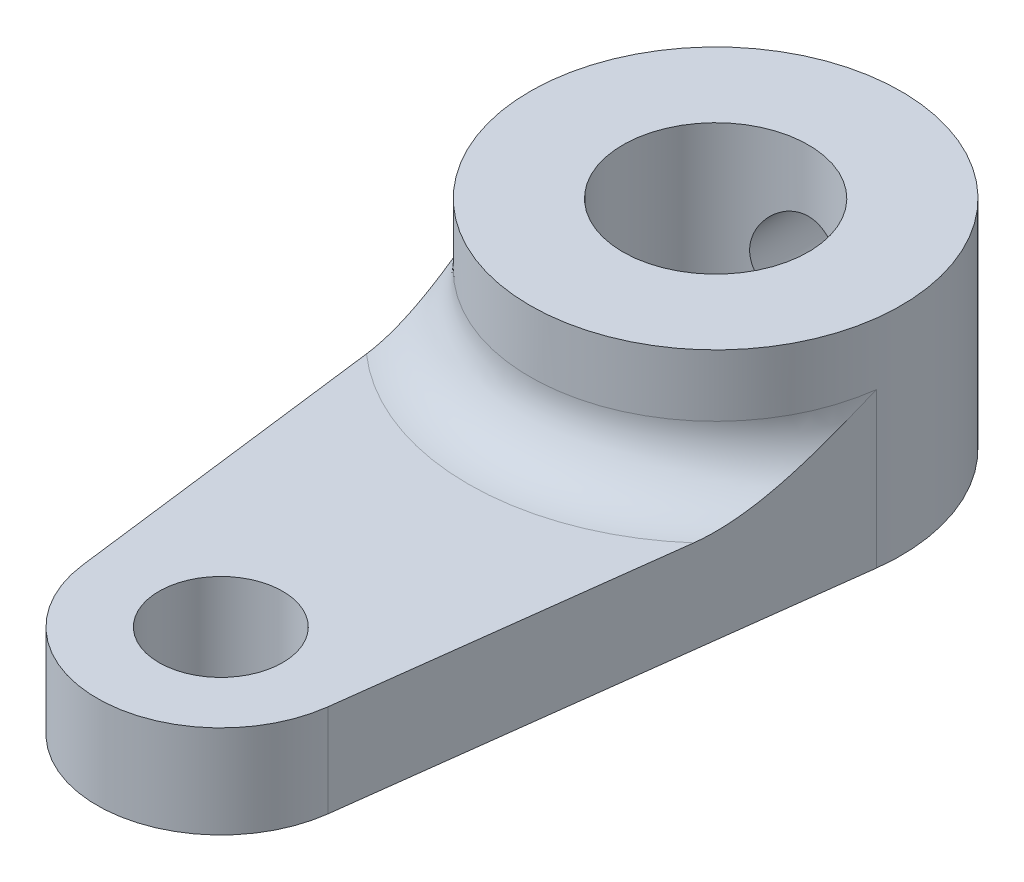
ISO-10303-21;
HEADER;
FILE_DESCRIPTION(('STEP AP214'),'2;1');
FILE_NAME('part.step','',(''),(''),'','','');
FILE_SCHEMA(('AUTOMOTIVE_DESIGN { 1 0 10303 214 1 1 1 1 }'));
ENDSEC;
DATA;
#1=APPLICATION_CONTEXT('core data for automotive mechanical design processes');
#2=APPLICATION_PROTOCOL_DEFINITION('international standard','automotive_design',2000,#1);
#3=PRODUCT_CONTEXT('',#1,'mechanical');
#4=PRODUCT('Part','Part','',(#3));
#5=PRODUCT_RELATED_PRODUCT_CATEGORY('part','',(#4));
#6=PRODUCT_DEFINITION_FORMATION('','',#4);
#7=PRODUCT_DEFINITION_CONTEXT('part definition',#1,'design');
#8=PRODUCT_DEFINITION('design','',#6,#7);
#9=PRODUCT_DEFINITION_SHAPE('','',#8);
#10=(LENGTH_UNIT() NAMED_UNIT(*) SI_UNIT(.MILLI.,.METRE.));
#11=(NAMED_UNIT(*) PLANE_ANGLE_UNIT() SI_UNIT($,.RADIAN.));
#12=(NAMED_UNIT(*) SI_UNIT($,.STERADIAN.) SOLID_ANGLE_UNIT());
#13=UNCERTAINTY_MEASURE_WITH_UNIT(LENGTH_MEASURE(1.E-05),#10,'distance_accuracy_value','');
#14=(GEOMETRIC_REPRESENTATION_CONTEXT(3) GLOBAL_UNCERTAINTY_ASSIGNED_CONTEXT((#13)) GLOBAL_UNIT_ASSIGNED_CONTEXT((#10,
#11,#12)) REPRESENTATION_CONTEXT('',''));
#15=CARTESIAN_POINT('',(0.,0.,0.));
#16=DIRECTION('',(0.,0.,1.));
#17=DIRECTION('',(1.,0.,0.));
#18=AXIS2_PLACEMENT_3D('',#15,#16,#17);
#19=CARTESIAN_POINT('',(-5.95294044989533,3.,0.750000000000001));
#20=DIRECTION('',(0.992156741649221,0.,-0.125));
#21=DIRECTION('',(-0.125,0.,-0.992156741649222));
#22=AXIS2_PLACEMENT_3D('',#19,#20,#21);
#23=PLANE('',#22);
#24=DIRECTION('',(0.125,0.,0.992156741649222));
#25=VECTOR('',#24,1.);
#26=CARTESIAN_POINT('',(-5.95294044989533,0.,0.750000000000001));
#27=LINE('',#26,#25);
#28=CARTESIAN_POINT('',(-5.95294044989533,0.,0.750000000000001));
#29=VERTEX_POINT('',#28);
#30=CARTESIAN_POINT('',(-3.96862696659688,0.,16.5));
#31=VERTEX_POINT('',#30);
#32=EDGE_CURVE('E168',#29,#31,#27,.T.);
#33=ORIENTED_EDGE('',*,*,#32,.T.);
#34=DIRECTION('',(0.,-1.,0.));
#35=VECTOR('',#34,1.);
#36=CARTESIAN_POINT('',(-3.96862696659688,3.,16.5));
#37=LINE('',#36,#35);
#38=CARTESIAN_POINT('',(-3.96862696659688,3.,16.5));
#39=VERTEX_POINT('',#38);
#40=EDGE_CURVE('E161',#39,#31,#37,.T.);
#41=ORIENTED_EDGE('',*,*,#40,.F.);
#42=DIRECTION('',(0.125,0.,0.992156741649222));
#43=VECTOR('',#42,1.);
#44=CARTESIAN_POINT('',(-5.95294044989533,3.,0.750000000000001));
#45=LINE('',#44,#43);
#46=CARTESIAN_POINT('',(-5.29150262212918,3.,6.));
#47=VERTEX_POINT('',#46);
#48=EDGE_CURVE('E146',#47,#39,#45,.T.);
#49=ORIENTED_EDGE('',*,*,#48,.F.);
#50=CARTESIAN_POINT('',(-5.29150262212918,3.,6.));
#51=CARTESIAN_POINT('',(-5.31039781985102,3.00003932371851,5.85002401756384));
#52=CARTESIAN_POINT('',(-5.32927068108454,3.00749080861605,5.7002253255075));
#53=CARTESIAN_POINT('',(-5.36682983971674,3.03529748814447,5.40210874592657));
#54=CARTESIAN_POINT('',(-5.38551644968368,3.05562506504879,5.25378837746843));
#55=CARTESIAN_POINT('',(-5.42237695613106,3.10690972129876,4.96121717768945));
#56=CARTESIAN_POINT('',(-5.44055436264542,3.13771036698746,4.81693848633806));
#57=CARTESIAN_POINT('',(-5.47663555915593,3.20848018103607,4.5305528674207));
#58=CARTESIAN_POINT('',(-5.49453918362414,3.24845467894679,4.38844725369198));
#59=CARTESIAN_POINT('',(-5.5510486235935,3.38804779430903,3.93991747903264));
#60=CARTESIAN_POINT('',(-5.589090545969,3.5022836971656,3.63796908103139));
#61=CARTESIAN_POINT('',(-5.66384180156038,3.75580816906779,3.04464938357758));
#62=CARTESIAN_POINT('',(-5.70054954085287,3.89512559194145,2.75329073549965));
#63=CARTESIAN_POINT('',(-5.8096367203732,4.33812108028087,1.88743809079078));
#64=CARTESIAN_POINT('',(-5.88048240155265,4.66533067276013,1.3251179291993));
#65=CARTESIAN_POINT('',(-5.95182241893325,4.99483605454589,0.758874095651225));
#66=CARTESIAN_POINT('',(-5.95238143594606,4.99741804396551,0.754437035667543));
#67=CARTESIAN_POINT('',(-5.95294044989533,5.,0.750000000000002));
#68=B_SPLINE_CURVE_WITH_KNOTS('',3,(#50,#51,#52,#53,#54,#55,#56,#57,#58,#59,#60,#61,#62,#63,#64,
#65,#66,#67),.UNSPECIFIED.,.F.,.F.,(4,2,2,2,2,2,2,2,4),(0.,0.453047985174248,0.905127510168364,
1.35073120961666,1.79659444088085,2.76988627914161,3.74430503334663,5.70583133706981,
5.72132327058452),.UNSPECIFIED.);
#69=CARTESIAN_POINT('',(-5.95294044989533,5.,0.750000000000001));
#70=VERTEX_POINT('',#69);
#71=EDGE_CURVE('E50',#47,#70,#68,.T.);
#72=ORIENTED_EDGE('',*,*,#71,.T.);
#73=DIRECTION('',(0.,-1.,0.));
#74=VECTOR('',#73,1.);
#75=CARTESIAN_POINT('',(-5.95294044989533,3.,0.750000000000001));
#76=LINE('',#75,#74);
#77=EDGE_CURVE('E336',#70,#29,#76,.T.);
#78=ORIENTED_EDGE('',*,*,#77,.T.);
#79=EDGE_LOOP('',(#33,#41,#49,#72,#78));
#80=FACE_BOUND('',#79,.T.);
#81=ADVANCED_FACE('F95',(#80),#23,.F.);
#82=CARTESIAN_POINT('',(0.,3.,16.));
#83=DIRECTION('',(0.,-1.,0.));
#84=DIRECTION('',(0.,0.,-1.));
#85=AXIS2_PLACEMENT_3D('',#82,#83,#84);
#86=CYLINDRICAL_SURFACE('',#85,4.);
#87=CARTESIAN_POINT('',(0.,0.,16.));
#88=DIRECTION('',(0.,1.,0.));
#89=DIRECTION('',(0.,0.,1.));
#90=AXIS2_PLACEMENT_3D('',#87,#88,#89);
#91=CIRCLE('',#90,4.);
#92=CARTESIAN_POINT('',(3.96862696659689,0.,16.5));
#93=VERTEX_POINT('',#92);
#94=EDGE_CURVE('E338',#31,#93,#91,.T.);
#95=ORIENTED_EDGE('',*,*,#94,.T.);
#96=DIRECTION('',(0.,-1.,0.));
#97=VECTOR('',#96,1.);
#98=CARTESIAN_POINT('',(3.96862696659689,3.,16.5));
#99=LINE('',#98,#97);
#100=CARTESIAN_POINT('',(3.96862696659689,3.,16.5));
#101=VERTEX_POINT('',#100);
#102=EDGE_CURVE('E163',#101,#93,#99,.T.);
#103=ORIENTED_EDGE('',*,*,#102,.F.);
#104=CARTESIAN_POINT('',(0.,3.,16.));
#105=DIRECTION('',(0.,1.,0.));
#106=DIRECTION('',(0.,0.,1.));
#107=AXIS2_PLACEMENT_3D('',#104,#105,#106);
#108=CIRCLE('',#107,4.);
#109=EDGE_CURVE('E150',#39,#101,#108,.T.);
#110=ORIENTED_EDGE('',*,*,#109,.F.);
#111=ORIENTED_EDGE('',*,*,#40,.T.);
#112=EDGE_LOOP('',(#95,#103,#110,#111));
#113=FACE_BOUND('',#112,.T.);
#114=ADVANCED_FACE('F160',(#113),#86,.T.);
#115=CARTESIAN_POINT('',(5.95294044989533,3.,0.75));
#116=DIRECTION('',(0.992156741649221,0.,0.125));
#117=DIRECTION('',(0.125,0.,-0.992156741649222));
#118=AXIS2_PLACEMENT_3D('',#115,#116,#117);
#119=PLANE('',#118);
#120=DIRECTION('',(-0.125,0.,0.992156741649222));
#121=VECTOR('',#120,1.);
#122=CARTESIAN_POINT('',(5.95294044989533,0.,0.75));
#123=LINE('',#122,#121);
#124=CARTESIAN_POINT('',(5.95294044989533,0.,0.75));
#125=VERTEX_POINT('',#124);
#126=EDGE_CURVE('E340',#125,#93,#123,.T.);
#127=ORIENTED_EDGE('',*,*,#126,.F.);
#128=DIRECTION('',(0.,-1.,0.));
#129=VECTOR('',#128,1.);
#130=CARTESIAN_POINT('',(5.95294044989533,3.,0.75));
#131=LINE('',#130,#129);
#132=CARTESIAN_POINT('',(5.95294044989533,5.,0.75));
#133=VERTEX_POINT('',#132);
#134=EDGE_CURVE('E173',#133,#125,#131,.T.);
#135=ORIENTED_EDGE('',*,*,#134,.F.);
#136=CARTESIAN_POINT('',(5.29150262212918,3.,6.));
#137=CARTESIAN_POINT('',(5.31039781985097,3.00003932371851,5.85002401756428));
#138=CARTESIAN_POINT('',(5.32927068108443,3.00749080861601,5.70022532550839));
#139=CARTESIAN_POINT('',(5.36682983971653,3.03529748814427,5.40210874592826));
#140=CARTESIAN_POINT('',(5.38551644968343,3.0556250650485,5.25378837747046));
#141=CARTESIAN_POINT('',(5.42237695613082,3.10690972129836,4.96121717769137));
#142=CARTESIAN_POINT('',(5.44055436264524,3.13771036698711,4.81693848633955));
#143=CARTESIAN_POINT('',(5.47663555915584,3.20848018103589,4.53055286742141));
#144=CARTESIAN_POINT('',(5.4945391836241,3.24845467894673,4.38844725369236));
#145=CARTESIAN_POINT('',(5.55104862359352,3.38804779430897,3.93991747903248));
#146=CARTESIAN_POINT('',(5.58909054596907,3.50228369716513,3.63796908103086));
#147=CARTESIAN_POINT('',(5.66384180156042,3.75580816906862,3.04464938357725));
#148=CARTESIAN_POINT('',(5.70054954085284,3.89512559194401,2.75329073549988));
#149=CARTESIAN_POINT('',(5.80963672037361,4.33812108027712,1.88743809078757));
#150=CARTESIAN_POINT('',(5.88048240155438,4.66533067273712,1.32511792918567));
#151=CARTESIAN_POINT('',(5.95182241893326,4.99483605454548,0.758874095651081));
#152=CARTESIAN_POINT('',(5.95238143594607,4.99741804396531,0.75443703566747));
#153=CARTESIAN_POINT('',(5.95294044989533,5.,0.75));
#154=B_SPLINE_CURVE_WITH_KNOTS('',3,(#136,#137,#138,#139,#140,#141,#142,#143,#144,#145,#146,
#147,#148,#149,#150,#151,#152,#153),.UNSPECIFIED.,.F.,.F.,(4,2,2,2,2,2,2,2,4),(0.,
0.45304798517289,0.905127510165945,1.35073120961554,1.79659444088085,2.76988627914195,
3.74430503334806,5.7058313370697,5.72132327058453),.UNSPECIFIED.);
#155=CARTESIAN_POINT('',(5.29150262212918,3.,6.));
#156=VERTEX_POINT('',#155);
#157=EDGE_CURVE('E110',#133,#156,#154,.F.);
#158=ORIENTED_EDGE('',*,*,#157,.T.);
#159=DIRECTION('',(-0.125,0.,0.992156741649222));
#160=VECTOR('',#159,1.);
#161=CARTESIAN_POINT('',(5.95294044989533,3.,0.75));
#162=LINE('',#161,#160);
#163=EDGE_CURVE('E164',#156,#101,#162,.T.);
#164=ORIENTED_EDGE('',*,*,#163,.T.);
#165=ORIENTED_EDGE('',*,*,#102,.T.);
#166=EDGE_LOOP('',(#127,#135,#158,#164,#165));
#167=FACE_BOUND('',#166,.T.);
#168=ADVANCED_FACE('F187',(#167),#119,.T.);
#169=CARTESIAN_POINT('',(0.,3.,0.));
#170=DIRECTION('',(0.,-1.,0.));
#171=DIRECTION('',(0.,0.,-1.));
#172=AXIS2_PLACEMENT_3D('',#169,#170,#171);
#173=CYLINDRICAL_SURFACE('',#172,3.);
#174=CARTESIAN_POINT('',(0.,5.,-3.));
#175=CARTESIAN_POINT('',(-0.0788579444268501,4.99999504652421,-2.99999570107562));
#176=CARTESIAN_POINT('',(-0.157809899546343,4.99374489031841,-2.99685736529635));
#177=CARTESIAN_POINT('',(-0.313380352903344,4.96902067948769,-2.98461234055736));
#178=CARTESIAN_POINT('',(-0.389994130070444,4.95052341050327,-2.97549431743379));
#179=CARTESIAN_POINT('',(-0.538400317320673,4.90220928707506,-2.95224419105063));
#180=CARTESIAN_POINT('',(-0.610210204408719,4.87243642362805,-2.93813158766306));
#181=CARTESIAN_POINT('',(-0.747708925209897,4.80264406795252,-2.90618664773642));
#182=CARTESIAN_POINT('',(-0.813398240985088,4.7626253836267,-2.88835460450288));
#183=CARTESIAN_POINT('',(-0.941261726642863,4.67072412577207,-2.84934387387093));
#184=CARTESIAN_POINT('',(-1.00298281668316,4.61827028114054,-2.82802798691306));
#185=CARTESIAN_POINT('',(-1.11716916730047,4.50421778112944,-2.78489955370115));
#186=CARTESIAN_POINT('',(-1.16962737466015,4.44261222234134,-2.76308664313552));
#187=CARTESIAN_POINT('',(-1.26787800067542,4.30627497571493,-2.71948426796021));
#188=CARTESIAN_POINT('',(-1.31283800332745,4.23089585248113,-2.69782780455198));
#189=CARTESIAN_POINT('',(-1.38925234033604,4.07244899602068,-2.65928968158481));
#190=CARTESIAN_POINT('',(-1.4207163224495,3.98938680691588,-2.64240461410485));
#191=CARTESIAN_POINT('',(-1.46719866328288,3.82300234186712,-2.61686800556713));
#192=CARTESIAN_POINT('',(-1.48308878562066,3.73999332189891,-2.6077840737557));
#193=CARTESIAN_POINT('',(-1.50064048996327,3.57203174333079,-2.59772834922792));
#194=CARTESIAN_POINT('',(-1.50231613255961,3.48708118869327,-2.59674854014932));
#195=CARTESIAN_POINT('',(-1.49203093075844,3.32857096352695,-2.60266395385873));
#196=CARTESIAN_POINT('',(-1.48167683930523,3.25486395316542,-2.6086314549302));
#197=CARTESIAN_POINT('',(-1.4504097735854,3.11041713594044,-2.62614343100776));
#198=CARTESIAN_POINT('',(-1.42949343584648,3.03967828204203,-2.63768968247665));
#199=CARTESIAN_POINT('',(-1.377314670579,2.90115630115151,-2.66531214619112));
#200=CARTESIAN_POINT('',(-1.34582260067399,2.83348040182132,-2.68148760995998));
#201=CARTESIAN_POINT('',(-1.273562531502,2.70404856111499,-2.71655106422106));
#202=CARTESIAN_POINT('',(-1.2327903657187,2.64229529659987,-2.73544027170286));
#203=CARTESIAN_POINT('',(-1.13709908236918,2.51821812088516,-2.77669736854929));
#204=CARTESIAN_POINT('',(-1.08104168755392,2.45681468963577,-2.79920265355119));
#205=CARTESIAN_POINT('',(-0.959333368112059,2.34389687211365,-2.84321434950611));
#206=CARTESIAN_POINT('',(-0.893677884861427,2.29238721194918,-2.86472027938201));
#207=CARTESIAN_POINT('',(-0.750774758747772,2.19847150845541,-2.90552980924446));
#208=CARTESIAN_POINT('',(-0.673130387399112,2.15659929133139,-2.92468476243011));
#209=CARTESIAN_POINT('',(-0.510699323233195,2.08685445643549,-2.95736821681863));
#210=CARTESIAN_POINT('',(-0.425918364397913,2.05897072247725,-2.9709011841533));
#211=CARTESIAN_POINT('',(-0.259149737491054,2.02028689442499,-2.98986500612153));
#212=CARTESIAN_POINT('',(-0.17751229582249,2.00826314637983,-2.99587407451965));
#213=CARTESIAN_POINT('',(-0.0131693999240281,1.99780290329827,-3.00109520188655));
#214=CARTESIAN_POINT('',(0.0695355298048626,1.9993599715408,-3.00031048081978));
#215=CARTESIAN_POINT('',(0.22684945797898,2.01531003262812,-2.99236788380152));
#216=CARTESIAN_POINT('',(0.301589112074894,2.02869879909499,-2.98570868532253));
#217=CARTESIAN_POINT('',(0.447610338452911,2.06635710784268,-2.9673325697226));
#218=CARTESIAN_POINT('',(0.518891528536629,2.09062784968024,-2.95561509501618));
#219=CARTESIAN_POINT('',(0.658332912674358,2.14999769964955,-2.92776377120382));
#220=CARTESIAN_POINT('',(0.726345595508704,2.18538657517443,-2.91151322654446));
#221=CARTESIAN_POINT('',(0.855692042548906,2.26566130346985,-2.87615961476126));
#222=CARTESIAN_POINT('',(0.917022944664886,2.31055120189309,-2.85705533350408));
#223=CARTESIAN_POINT('',(1.03765153393382,2.41364063799608,-2.81562332004297));
#224=CARTESIAN_POINT('',(1.09615811672854,2.47271430266772,-2.79316327265249));
#225=CARTESIAN_POINT('',(1.20278448167828,2.59988772691659,-2.7489358741323));
#226=CARTESIAN_POINT('',(1.25089707856781,2.66799367827188,-2.72716901100071));
#227=CARTESIAN_POINT('',(1.33756187171852,2.81546548125946,-2.68576788309734));
#228=CARTESIAN_POINT('',(1.37553824370037,2.89521689914172,-2.66628794383591));
#229=CARTESIAN_POINT('',(1.43712423890205,3.06126510136245,-2.63361108441202));
#230=CARTESIAN_POINT('',(1.46075237380052,3.14755328970034,-2.62040607332625));
#231=CARTESIAN_POINT('',(1.49079253120031,3.31536533432706,-2.60342251538703));
#232=CARTESIAN_POINT('',(1.49863949460818,3.39655138015286,-2.59886075197598));
#233=CARTESIAN_POINT('',(1.5010337315643,3.55917060074679,-2.59748031962405));
#234=CARTESIAN_POINT('',(1.49558676993486,3.64060365310679,-2.60065829439585));
#235=CARTESIAN_POINT('',(1.47288918838996,3.79322525230016,-2.61356793076615));
#236=CARTESIAN_POINT('',(1.45681247151455,3.86465070521711,-2.62264641723988));
#237=CARTESIAN_POINT('',(1.41476303733661,4.00371217913655,-2.64556524281479));
#238=CARTESIAN_POINT('',(1.38878713673988,4.07134697313805,-2.65940711354503));
#239=CARTESIAN_POINT('',(1.32572361795084,4.2059372764798,-2.69142795546804));
#240=CARTESIAN_POINT('',(1.28800670672355,4.27254185274354,-2.70983583593881));
#241=CARTESIAN_POINT('',(1.20322645745609,4.39891180427189,-2.74852997452291));
#242=CARTESIAN_POINT('',(1.15615825686234,4.45867359578167,-2.76881720693416));
#243=CARTESIAN_POINT('',(1.04730498999206,4.57721297353201,-2.81193484737138));
#244=CARTESIAN_POINT('',(0.984426634495891,4.63498865352543,-2.83477474959942));
#245=CARTESIAN_POINT('',(0.849232209349794,4.7393944751529,-2.87816628389896));
#246=CARTESIAN_POINT('',(0.776911084957794,4.78601860920486,-2.89871667939293));
#247=CARTESIAN_POINT('',(0.623897395174417,4.8668545440681,-2.93547014349806));
#248=CARTESIAN_POINT('',(0.543149255665094,4.9009762538547,-2.95164144740899));
#249=CARTESIAN_POINT('',(0.376113151707129,4.95471225163611,-2.9775201194848));
#250=CARTESIAN_POINT('',(0.289841699383649,4.97436777020857,-2.98724585044602));
#251=CARTESIAN_POINT('',(0.168902919736342,4.99084611662861,-2.99543192870217));
#252=CARTESIAN_POINT('',(0.135242819162347,4.99427396129951,-2.99714048010376));
#253=CARTESIAN_POINT('',(0.0677275977076368,4.99885199827112,-2.99942545465223));
#254=CARTESIAN_POINT('',(0.0338724714699424,5.00000212770531,-3.00000184655071));
#255=CARTESIAN_POINT('',(0.,5.,-3.));
#256=B_SPLINE_CURVE_WITH_KNOTS('',3,(#174,#175,#176,#177,#178,#179,#180,#181,#182,#183,#184,
#185,#186,#187,#188,#189,#190,#191,#192,#193,#194,#195,#196,#197,#198,#199,#200,#201,#202,#203,
#204,#205,#206,#207,#208,#209,#210,#211,#212,#213,#214,#215,#216,#217,#218,#219,#220,#221,#222,
#223,#224,#225,#226,#227,#228,#229,#230,#231,#232,#233,#234,#235,#236,#237,#238,#239,#240,#241,
#242,#243,#244,#245,#246,#247,#248,#249,#250,#251,#252,#253,#254,#255),.UNSPECIFIED.,.T.,.F.,(4,
2,2,2,2,2,2,2,2,2,2,2,2,2,2,2,2,2,2,2,2,2,2,2,2,2,2,2,2,2,2,2,2,2,2,2,2,2,2,2,4),(0.,
0.236436386130438,0.473322224563796,0.709293233238447,0.94524564087235,1.19547263807713,
1.44588935648105,1.71572589646129,1.98536921847421,2.23887018210344,2.4921203599353,
2.71508568613981,2.93812205888517,3.16635360252731,3.39468781890332,3.65197412000817,
3.90938301898029,4.1787453332166,4.44789325368419,4.69474935707018,4.94148846767213,
5.16910359759182,5.39674382446396,5.63089284041847,5.86514176122508,6.12239415966627,
6.37982382923147,6.64972023242588,6.91926767918175,7.16293961254569,7.40650589797016,
7.62686895373283,7.84730293182526,8.0825468517043,8.31791341715445,8.58187864135756,
8.84598575071867,9.11196020495289,9.37717362931723,9.47872920200874,9.58028757766598),.UNSPECIFIED.);
#257=CARTESIAN_POINT('',(0.,5.,-3.));
#258=VERTEX_POINT('',#257);
#259=EDGE_CURVE('E320',#258,#258,#256,.T.);
#260=ORIENTED_EDGE('',*,*,#259,.F.);
#261=EDGE_LOOP('',(#260));
#262=FACE_BOUND('',#261,.T.);
#263=CARTESIAN_POINT('',(0.,0.,0.));
#264=DIRECTION('',(0.,1.,0.));
#265=DIRECTION('',(0.,0.,1.));
#266=AXIS2_PLACEMENT_3D('',#263,#264,#265);
#267=CIRCLE('',#266,3.);
#268=CARTESIAN_POINT('',(0.,0.,3.));
#269=VERTEX_POINT('',#268);
#270=EDGE_CURVE('E345',#269,#269,#267,.T.);
#271=ORIENTED_EDGE('',*,*,#270,.F.);
#272=EDGE_LOOP('',(#271));
#273=FACE_BOUND('',#272,.T.);
#274=CARTESIAN_POINT('',(0.,7.,0.));
#275=DIRECTION('',(0.,1.,0.));
#276=DIRECTION('',(0.,0.,1.));
#277=AXIS2_PLACEMENT_3D('',#274,#275,#276);
#278=CIRCLE('',#277,3.);
#279=CARTESIAN_POINT('',(0.,7.,3.));
#280=VERTEX_POINT('',#279);
#281=EDGE_CURVE('E329',#280,#280,#278,.T.);
#282=ORIENTED_EDGE('',*,*,#281,.T.);
#283=EDGE_LOOP('',(#282));
#284=FACE_BOUND('',#283,.T.);
#285=ADVANCED_FACE('F191',(#262,#273,#284),#173,.F.);
#286=CARTESIAN_POINT('',(0.,3.,0.));
#287=DIRECTION('',(0.,-1.,0.));
#288=DIRECTION('',(0.,0.,-1.));
#289=AXIS2_PLACEMENT_3D('',#286,#287,#288);
#290=CYLINDRICAL_SURFACE('',#289,6.);
#291=CARTESIAN_POINT('',(0.,5.,-6.));
#292=CARTESIAN_POINT('',(-0.082876088669731,4.99999767426184,-5.99999859868013));
#293=CARTESIAN_POINT('',(-0.165778157830763,4.99310844922621,-5.99826578131828));
#294=CARTESIAN_POINT('',(-0.329206323770532,4.96577484869299,-5.99152113829892));
#295=CARTESIAN_POINT('',(-0.409731046870739,4.94532279046215,-5.98650745419968));
#296=CARTESIAN_POINT('',(-0.566020872182576,4.89156074653791,-5.9737562633204));
#297=CARTESIAN_POINT('',(-0.641791563430002,4.85826620128472,-5.96602202842087));
#298=CARTESIAN_POINT('',(-0.786672131904425,4.77981860995516,-5.94865343807593));
#299=CARTESIAN_POINT('',(-0.855781784348758,4.73466516388106,-5.9390190185405));
#300=CARTESIAN_POINT('',(-0.986801927300918,4.63279921034579,-5.91867413591801));
#301=CARTESIAN_POINT('',(-1.04855569006107,4.57588842504082,-5.90794707148533));
#302=CARTESIAN_POINT('',(-1.1617489272033,4.45254779509108,-5.8867362011753));
#303=CARTESIAN_POINT('',(-1.21318723694913,4.3861168770535,-5.87625242288349));
#304=CARTESIAN_POINT('',(-1.30502654279903,4.24440477326256,-5.8565477569971));
#305=CARTESIAN_POINT('',(-1.34525221592535,4.1690067691896,-5.84734794470605));
#306=CARTESIAN_POINT('',(-1.41239690855053,4.01225158834164,-5.83149494812223));
#307=CARTESIAN_POINT('',(-1.43931805543933,3.93089536667424,-5.82484135672789));
#308=CARTESIAN_POINT('',(-1.47855483680429,3.76625650179753,-5.81500476717551));
#309=CARTESIAN_POINT('',(-1.49115226833334,3.6830451039502,-5.81175491075426));
#310=CARTESIAN_POINT('',(-1.50226177506785,3.51563143098602,-5.80889362537741));
#311=CARTESIAN_POINT('',(-1.50077614181798,3.43142931930139,-5.80928160448644));
#312=CARTESIAN_POINT('',(-1.48398652463928,3.26658419225552,-5.81359205496618));
#313=CARTESIAN_POINT('',(-1.46901834019052,3.1859043785349,-5.81742863001879));
#314=CARTESIAN_POINT('',(-1.4262241869031,3.02823894908871,-5.82806709676484));
#315=CARTESIAN_POINT('',(-1.39839730206942,2.95125359697102,-5.83486919970697));
#316=CARTESIAN_POINT('',(-1.33038947793715,2.80226198374794,-5.85075113904187));
#317=CARTESIAN_POINT('',(-1.29008666723291,2.73031382821045,-5.85985327469421));
#318=CARTESIAN_POINT('',(-1.19835627601495,2.59408129024316,-5.87929710846386));
#319=CARTESIAN_POINT('',(-1.14692674880884,2.52979825193275,-5.88963902334735));
#320=CARTESIAN_POINT('',(-1.03266342468122,2.4087963843056,-5.91075880539781));
#321=CARTESIAN_POINT('',(-0.969546258165859,2.35234550993865,-5.92154069477971));
#322=CARTESIAN_POINT('',(-0.834611917503699,2.2507787575361,-5.94205965578786));
#323=CARTESIAN_POINT('',(-0.762794477707943,2.20566322573644,-5.95179669549415));
#324=CARTESIAN_POINT('',(-0.612115888681391,2.12794941377562,-5.96917732094183));
#325=CARTESIAN_POINT('',(-0.533231393208623,2.09539465974557,-5.97681360127725));
#326=CARTESIAN_POINT('',(-0.370876008142883,2.04408269429043,-5.98907916991419));
#327=CARTESIAN_POINT('',(-0.287405999150485,2.02532284358186,-5.99370903339281));
#328=CARTESIAN_POINT('',(-0.120539970390027,2.00254243444116,-5.99935499271375));
#329=CARTESIAN_POINT('',(-0.0371967199882101,1.9981569739247,-6.00046053508279));
#330=CARTESIAN_POINT('',(0.129032874801508,2.00324900205549,-5.99918804814451));
#331=CARTESIAN_POINT('',(0.211919259644594,2.01272524279914,-5.99681033241847));
#332=CARTESIAN_POINT('',(0.373614268776491,2.04497090839138,-5.98889581127357));
#333=CARTESIAN_POINT('',(0.452465118968754,2.06754126347699,-5.98340634185811));
#334=CARTESIAN_POINT('',(0.605257292452511,2.12510708402845,-5.96988706634134));
#335=CARTESIAN_POINT('',(0.679198119032634,2.16010380431317,-5.96185700369892));
#336=CARTESIAN_POINT('',(0.821523134429846,2.24223612887473,-5.9439330792631));
#337=CARTESIAN_POINT('',(0.889785441835829,2.28957611239676,-5.93400867366932));
#338=CARTESIAN_POINT('',(1.01752661364324,2.39478990879697,-5.91344509187419));
#339=CARTESIAN_POINT('',(1.07700395897301,2.45266553961691,-5.90280579251705));
#340=CARTESIAN_POINT('',(1.18699056807273,2.57900196084447,-5.88168956960771));
#341=CARTESIAN_POINT('',(1.23724386762203,2.64768770300242,-5.87122304187281));
#342=CARTESIAN_POINT('',(1.3255107590127,2.79273263446572,-5.85192878377239));
#343=CARTESIAN_POINT('',(1.36352489415793,2.86909148295975,-5.84310098067026));
#344=CARTESIAN_POINT('',(1.42595142060929,3.02690572241308,-5.82818094734665));
#345=CARTESIAN_POINT('',(1.45044439665406,3.10832762834401,-5.82207255291906));
#346=CARTESIAN_POINT('',(1.48534565995378,3.27430963788911,-5.81326744090184));
#347=CARTESIAN_POINT('',(1.49575702747866,3.35886905103249,-5.81056997719936));
#348=CARTESIAN_POINT('',(1.50203859033399,3.5261210238552,-5.80894901203957));
#349=CARTESIAN_POINT('',(1.49831789778012,3.60879743512473,-5.80991932728264));
#350=CARTESIAN_POINT('',(1.47737727831287,3.77230388866798,-5.81527909007843));
#351=CARTESIAN_POINT('',(1.46015762268677,3.85313396801365,-5.81966846891857));
#352=CARTESIAN_POINT('',(1.41293131944279,4.01020845906541,-5.83131260682723));
#353=CARTESIAN_POINT('',(1.38300140468037,4.08647730524021,-5.8385501523631));
#354=CARTESIAN_POINT('',(1.31126491360507,4.23296538271369,-5.85507755724829));
#355=CARTESIAN_POINT('',(1.26945669003419,4.30318377318692,-5.86436770120773));
#356=CARTESIAN_POINT('',(1.17386774863713,4.43755462900202,-5.88425634263512));
#357=CARTESIAN_POINT('',(1.11980316291225,4.50150107342396,-5.89488264831757));
#358=CARTESIAN_POINT('',(1.00178937118973,4.61954704479541,-5.91608027246286));
#359=CARTESIAN_POINT('',(0.937837821261145,4.67364423011297,-5.9266515772706));
#360=CARTESIAN_POINT('',(0.800467586702589,4.77141130856461,-5.94677655647663));
#361=CARTESIAN_POINT('',(0.726898422316385,4.81487461367158,-5.95630833365868));
#362=CARTESIAN_POINT('',(0.573266059510475,4.88874746294053,-5.97304924975118));
#363=CARTESIAN_POINT('',(0.493207563436739,4.91916636064853,-5.98026005199781));
#364=CARTESIAN_POINT('',(0.344410253243471,4.96157183032965,-5.99048059565542));
#365=CARTESIAN_POINT('',(0.276380170908068,4.97595124305343,-5.99402585052691));
#366=CARTESIAN_POINT('',(0.138906071536283,4.99516594362194,-5.99878605231948));
#367=CARTESIAN_POINT('',(0.0694621612426162,5.0000019493053,-6.00000117450894));
#368=CARTESIAN_POINT('',(0.,5.,-6.));
#369=B_SPLINE_CURVE_WITH_KNOTS('',3,(#291,#292,#293,#294,#295,#296,#297,#298,#299,#300,#301,
#302,#303,#304,#305,#306,#307,#308,#309,#310,#311,#312,#313,#314,#315,#316,#317,#318,#319,#320,
#321,#322,#323,#324,#325,#326,#327,#328,#329,#330,#331,#332,#333,#334,#335,#336,#337,#338,#339,
#340,#341,#342,#343,#344,#345,#346,#347,#348,#349,#350,#351,#352,#353,#354,#355,#356,#357,#358,
#359,#360,#361,#362,#363,#364,#365,#366,#367,#368),.UNSPECIFIED.,.T.,.F.,(4,2,2,2,2,2,2,2,2,2,2,
2,2,2,2,2,2,2,2,2,2,2,2,2,2,2,2,2,2,2,2,2,2,2,2,2,2,2,4),(0.,0.248373712471889,
0.496888237763899,0.745104902286105,0.993329940169327,1.24614435437139,1.49898729580062,
1.75558647545807,2.01214461169368,2.2635629509943,2.51494038112696,2.76022497007018,
3.00552703466038,3.25330527873879,3.50112690836162,3.75601500969019,4.01091089558247,
4.26668229009113,4.52240473688642,4.77158308949276,5.02073901112742,5.26620274514037,
5.5116912732229,5.76153587565351,6.01142363008018,6.26744509204475,6.52345518749507,
6.77792254614035,7.03233423252407,7.27943780398611,7.52653640956033,7.77216400559446,
8.017825681369,8.26989576409909,8.52202569770416,8.77872185499587,9.03523363821349,
9.24342242942148,9.45159556043038),.UNSPECIFIED.);
#370=CARTESIAN_POINT('',(0.,5.,-6.));
#371=VERTEX_POINT('',#370);
#372=EDGE_CURVE('E100',#371,#371,#369,.T.);
#373=ORIENTED_EDGE('',*,*,#372,.T.);
#374=EDGE_LOOP('',(#373));
#375=FACE_BOUND('',#374,.T.);
#376=CARTESIAN_POINT('',(0.,5.,0.));
#377=DIRECTION('',(0.,1.,0.));
#378=DIRECTION('',(0.,0.,1.));
#379=AXIS2_PLACEMENT_3D('',#376,#377,#378);
#380=CIRCLE('',#379,6.);
#381=EDGE_CURVE('E169',#70,#133,#380,.T.);
#382=ORIENTED_EDGE('',*,*,#381,.T.);
#383=ORIENTED_EDGE('',*,*,#134,.T.);
#384=CARTESIAN_POINT('',(0.,0.,0.));
#385=DIRECTION('',(0.,1.,0.));
#386=DIRECTION('',(0.,0.,1.));
#387=AXIS2_PLACEMENT_3D('',#384,#385,#386);
#388=CIRCLE('',#387,6.);
#389=EDGE_CURVE('E343',#125,#29,#388,.T.);
#390=ORIENTED_EDGE('',*,*,#389,.T.);
#391=ORIENTED_EDGE('',*,*,#77,.F.);
#392=EDGE_LOOP('',(#382,#383,#390,#391));
#393=FACE_BOUND('',#392,.T.);
#394=CARTESIAN_POINT('',(0.,7.,0.));
#395=DIRECTION('',(0.,1.,0.));
#396=DIRECTION('',(0.,0.,1.));
#397=AXIS2_PLACEMENT_3D('',#394,#395,#396);
#398=CIRCLE('',#397,6.);
#399=CARTESIAN_POINT('',(0.,7.,6.));
#400=VERTEX_POINT('',#399);
#401=EDGE_CURVE('E325',#400,#400,#398,.T.);
#402=ORIENTED_EDGE('',*,*,#401,.F.);
#403=EDGE_LOOP('',(#402));
#404=FACE_BOUND('',#403,.T.);
#405=ADVANCED_FACE('F192',(#375,#393,#404),#290,.T.);
#406=CARTESIAN_POINT('',(0.,3.,16.));
#407=DIRECTION('',(0.,-1.,0.));
#408=DIRECTION('',(0.,0.,-1.));
#409=AXIS2_PLACEMENT_3D('',#406,#407,#408);
#410=CYLINDRICAL_SURFACE('',#409,2.);
#411=CARTESIAN_POINT('',(0.,3.,16.));
#412=DIRECTION('',(0.,1.,0.));
#413=DIRECTION('',(0.,0.,1.));
#414=AXIS2_PLACEMENT_3D('',#411,#412,#413);
#415=CIRCLE('',#414,2.);
#416=CARTESIAN_POINT('',(0.,3.,18.));
#417=VERTEX_POINT('',#416);
#418=EDGE_CURVE('E333',#417,#417,#415,.T.);
#419=ORIENTED_EDGE('',*,*,#418,.T.);
#420=EDGE_LOOP('',(#419));
#421=FACE_BOUND('',#420,.T.);
#422=CARTESIAN_POINT('',(0.,0.,16.));
#423=DIRECTION('',(0.,1.,0.));
#424=DIRECTION('',(0.,0.,1.));
#425=AXIS2_PLACEMENT_3D('',#422,#423,#424);
#426=CIRCLE('',#425,2.);
#427=CARTESIAN_POINT('',(0.,0.,18.));
#428=VERTEX_POINT('',#427);
#429=EDGE_CURVE('E155',#428,#428,#426,.T.);
#430=ORIENTED_EDGE('',*,*,#429,.F.);
#431=EDGE_LOOP('',(#430));
#432=FACE_BOUND('',#431,.T.);
#433=ADVANCED_FACE('F224',(#421,#432),#410,.F.);
#434=CARTESIAN_POINT('',(0.,3.,0.));
#435=DIRECTION('',(0.,1.,0.));
#436=DIRECTION('',(0.,0.,1.));
#437=AXIS2_PLACEMENT_3D('',#434,#435,#436);
#438=PLANE('',#437);
#439=ORIENTED_EDGE('',*,*,#163,.F.);
#440=CARTESIAN_POINT('',(0.,3.,0.));
#441=DIRECTION('',(0.,1.,0.));
#442=DIRECTION('',(0.,0.,1.));
#443=AXIS2_PLACEMENT_3D('',#440,#441,#442);
#444=CIRCLE('',#443,8.);
#445=EDGE_CURVE('E123',#156,#47,#444,.F.);
#446=ORIENTED_EDGE('',*,*,#445,.T.);
#447=ORIENTED_EDGE('',*,*,#48,.T.);
#448=ORIENTED_EDGE('',*,*,#109,.T.);
#449=EDGE_LOOP('',(#439,#446,#447,#448));
#450=FACE_BOUND('',#449,.T.);
#451=ORIENTED_EDGE('',*,*,#418,.F.);
#452=EDGE_LOOP('',(#451));
#453=FACE_BOUND('',#452,.T.);
#454=ADVANCED_FACE('F148',(#450,#453),#438,.T.);
#455=CARTESIAN_POINT('',(0.,0.,0.));
#456=DIRECTION('',(0.,1.,0.));
#457=DIRECTION('',(0.,0.,1.));
#458=AXIS2_PLACEMENT_3D('',#455,#456,#457);
#459=PLANE('',#458);
#460=ORIENTED_EDGE('',*,*,#32,.F.);
#461=ORIENTED_EDGE('',*,*,#389,.F.);
#462=ORIENTED_EDGE('',*,*,#126,.T.);
#463=ORIENTED_EDGE('',*,*,#94,.F.);
#464=EDGE_LOOP('',(#460,#461,#462,#463));
#465=FACE_BOUND('',#464,.T.);
#466=ORIENTED_EDGE('',*,*,#270,.T.);
#467=EDGE_LOOP('',(#466));
#468=FACE_BOUND('',#467,.T.);
#469=ORIENTED_EDGE('',*,*,#429,.T.);
#470=EDGE_LOOP('',(#469));
#471=FACE_BOUND('',#470,.T.);
#472=ADVANCED_FACE('F238',(#465,#468,#471),#459,.F.);
#473=CARTESIAN_POINT('',(0.,7.,0.));
#474=DIRECTION('',(0.,1.,0.));
#475=DIRECTION('',(0.,0.,1.));
#476=AXIS2_PLACEMENT_3D('',#473,#474,#475);
#477=PLANE('',#476);
#478=ORIENTED_EDGE('',*,*,#401,.T.);
#479=EDGE_LOOP('',(#478));
#480=FACE_BOUND('',#479,.T.);
#481=ORIENTED_EDGE('',*,*,#281,.F.);
#482=EDGE_LOOP('',(#481));
#483=FACE_BOUND('',#482,.T.);
#484=ADVANCED_FACE('F244',(#480,#483),#477,.T.);
#485=CARTESIAN_POINT('',(0.,5.,0.));
#486=DIRECTION('',(0.,1.,0.));
#487=DIRECTION('',(0.,0.,1.));
#488=AXIS2_PLACEMENT_3D('',#485,#486,#487);
#489=TOROIDAL_SURFACE('',#488,8.,2.);
#490=ORIENTED_EDGE('',*,*,#71,.F.);
#491=ORIENTED_EDGE('',*,*,#445,.F.);
#492=ORIENTED_EDGE('',*,*,#157,.F.);
#493=ORIENTED_EDGE('',*,*,#381,.F.);
#494=EDGE_LOOP('',(#490,#491,#492,#493));
#495=FACE_BOUND('',#494,.T.);
#496=ADVANCED_FACE('F97',(#495),#489,.F.);
#497=CARTESIAN_POINT('',(0.,3.5,-7.));
#498=DIRECTION('',(0.,0.,-1.));
#499=DIRECTION('',(-1.,0.,0.));
#500=AXIS2_PLACEMENT_3D('',#497,#498,#499);
#501=CYLINDRICAL_SURFACE('',#500,1.5);
#502=ORIENTED_EDGE('',*,*,#259,.T.);
#503=EDGE_LOOP('',(#502));
#504=FACE_BOUND('',#503,.T.);
#505=ORIENTED_EDGE('',*,*,#372,.F.);
#506=EDGE_LOOP('',(#505));
#507=FACE_BOUND('',#506,.T.);
#508=ADVANCED_FACE('F257',(#504,#507),#501,.F.);
#509=CLOSED_SHELL('',(#81,#114,#168,#285,#405,#433,#454,#472,#484,#496,#508));
#510=MANIFOLD_SOLID_BREP('B6',#509);
#511=ADVANCED_BREP_SHAPE_REPRESENTATION('',(#18,#510),#14);
#512=SHAPE_DEFINITION_REPRESENTATION(#9,#511);
ENDSEC;
END-ISO-10303-21;
